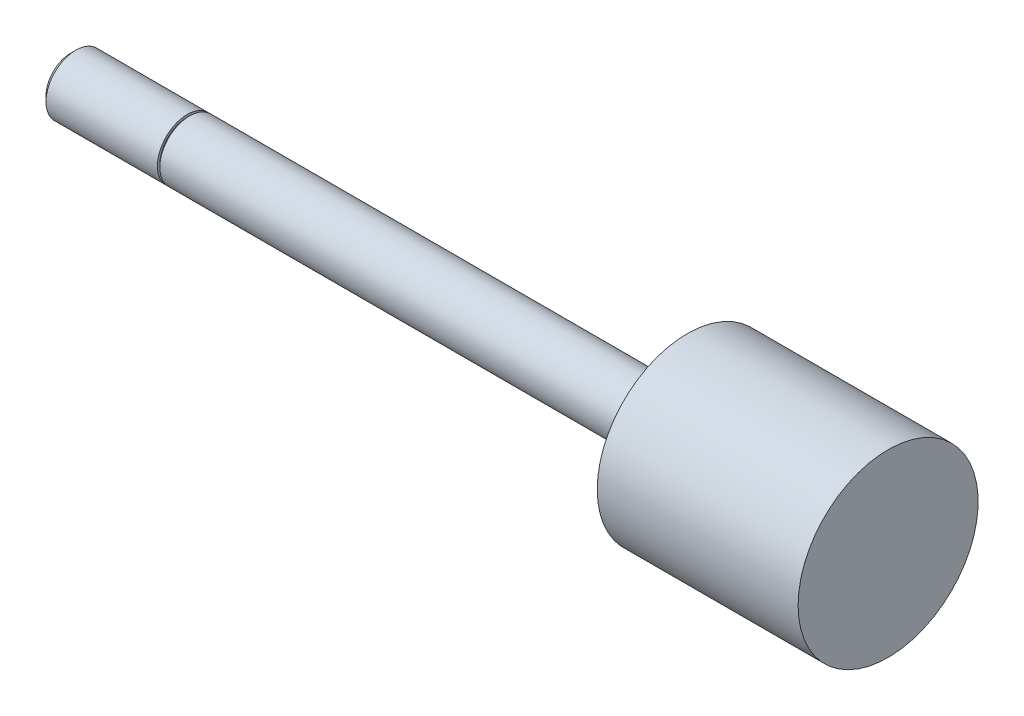
ISO-10303-21;
HEADER;
FILE_DESCRIPTION(('STEP AP214'),'2;1');
FILE_NAME('part.step','',(''),(''),'','','');
FILE_SCHEMA(('AUTOMOTIVE_DESIGN { 1 0 10303 214 1 1 1 1 }'));
ENDSEC;
DATA;
#1=APPLICATION_CONTEXT('core data for automotive mechanical design processes');
#2=APPLICATION_PROTOCOL_DEFINITION('international standard','automotive_design',2000,#1);
#3=PRODUCT_CONTEXT('',#1,'mechanical');
#4=PRODUCT('Part','Part','',(#3));
#5=PRODUCT_RELATED_PRODUCT_CATEGORY('part','',(#4));
#6=PRODUCT_DEFINITION_FORMATION('','',#4);
#7=PRODUCT_DEFINITION_CONTEXT('part definition',#1,'design');
#8=PRODUCT_DEFINITION('design','',#6,#7);
#9=PRODUCT_DEFINITION_SHAPE('','',#8);
#10=(LENGTH_UNIT() NAMED_UNIT(*) SI_UNIT(.MILLI.,.METRE.));
#11=(NAMED_UNIT(*) PLANE_ANGLE_UNIT() SI_UNIT($,.RADIAN.));
#12=(NAMED_UNIT(*) SI_UNIT($,.STERADIAN.) SOLID_ANGLE_UNIT());
#13=UNCERTAINTY_MEASURE_WITH_UNIT(LENGTH_MEASURE(1.E-05),#10,'distance_accuracy_value','');
#14=(GEOMETRIC_REPRESENTATION_CONTEXT(3) GLOBAL_UNCERTAINTY_ASSIGNED_CONTEXT((#13)) GLOBAL_UNIT_ASSIGNED_CONTEXT((#10,
#11,#12)) REPRESENTATION_CONTEXT('',''));
#15=CARTESIAN_POINT('',(0.,0.,0.));
#16=DIRECTION('',(0.,0.,1.));
#17=DIRECTION('',(1.,0.,0.));
#18=AXIS2_PLACEMENT_3D('',#15,#16,#17);
#19=CARTESIAN_POINT('',(74.6506,0.,0.));
#20=DIRECTION('',(-1.,0.,0.));
#21=DIRECTION('',(0.,0.,1.));
#22=AXIS2_PLACEMENT_3D('',#19,#20,#21);
#23=CYLINDRICAL_SURFACE('',#22,3.175);
#24=CARTESIAN_POINT('',(53.1876,0.,0.));
#25=DIRECTION('',(-1.,0.,0.));
#26=DIRECTION('',(0.,0.,1.));
#27=AXIS2_PLACEMENT_3D('',#24,#25,#26);
#28=CIRCLE('',#27,3.175);
#29=CARTESIAN_POINT('',(53.1876,0.,3.175));
#30=VERTEX_POINT('',#29);
#31=EDGE_CURVE('E10',#30,#30,#28,.T.);
#32=ORIENTED_EDGE('',*,*,#31,.T.);
#33=EDGE_LOOP('',(#32));
#34=FACE_BOUND('',#33,.T.);
#35=CARTESIAN_POINT('',(0.,0.,0.));
#36=DIRECTION('',(-1.,0.,0.));
#37=DIRECTION('',(0.,0.,1.));
#38=AXIS2_PLACEMENT_3D('',#35,#36,#37);
#39=CIRCLE('',#38,3.175);
#40=CARTESIAN_POINT('',(0.,0.,3.175));
#41=VERTEX_POINT('',#40);
#42=EDGE_CURVE('E53',#41,#41,#39,.T.);
#43=ORIENTED_EDGE('',*,*,#42,.F.);
#44=EDGE_LOOP('',(#43));
#45=FACE_BOUND('',#44,.T.);
#46=ADVANCED_FACE('F37',(#34,#45),#23,.T.);
#47=CARTESIAN_POINT('',(53.1876,3.175,0.));
#48=DIRECTION('',(1.,0.,0.));
#49=DIRECTION('',(0.,0.,-1.));
#50=AXIS2_PLACEMENT_3D('',#47,#48,#49);
#51=PLANE('',#50);
#52=ORIENTED_EDGE('',*,*,#31,.F.);
#53=EDGE_LOOP('',(#52));
#54=FACE_BOUND('',#53,.T.);
#55=CARTESIAN_POINT('',(53.1876,0.,0.));
#56=DIRECTION('',(-1.,0.,0.));
#57=DIRECTION('',(0.,0.,1.));
#58=AXIS2_PLACEMENT_3D('',#55,#56,#57);
#59=CIRCLE('',#58,9.62025);
#60=CARTESIAN_POINT('',(53.1876,0.,9.62025));
#61=VERTEX_POINT('',#60);
#62=EDGE_CURVE('E45',#61,#61,#59,.T.);
#63=ORIENTED_EDGE('',*,*,#62,.T.);
#64=EDGE_LOOP('',(#63));
#65=FACE_BOUND('',#64,.T.);
#66=ADVANCED_FACE('F87',(#54,#65),#51,.F.);
#67=CARTESIAN_POINT('',(74.6506,0.,0.));
#68=DIRECTION('',(-1.,0.,0.));
#69=DIRECTION('',(0.,0.,1.));
#70=AXIS2_PLACEMENT_3D('',#67,#68,#69);
#71=CYLINDRICAL_SURFACE('',#70,9.62025);
#72=ORIENTED_EDGE('',*,*,#62,.F.);
#73=EDGE_LOOP('',(#72));
#74=FACE_BOUND('',#73,.T.);
#75=CARTESIAN_POINT('',(74.6506,0.,0.));
#76=DIRECTION('',(-1.,0.,0.));
#77=DIRECTION('',(0.,0.,1.));
#78=AXIS2_PLACEMENT_3D('',#75,#76,#77);
#79=CIRCLE('',#78,9.62025);
#80=CARTESIAN_POINT('',(74.6506,0.,9.62025));
#81=VERTEX_POINT('',#80);
#82=EDGE_CURVE('E50',#81,#81,#79,.T.);
#83=ORIENTED_EDGE('',*,*,#82,.T.);
#84=EDGE_LOOP('',(#83));
#85=FACE_BOUND('',#84,.T.);
#86=ADVANCED_FACE('F75',(#74,#85),#71,.T.);
#87=CARTESIAN_POINT('',(74.6506,9.62025,0.));
#88=DIRECTION('',(-1.,0.,0.));
#89=DIRECTION('',(0.,0.,1.));
#90=AXIS2_PLACEMENT_3D('',#87,#88,#89);
#91=PLANE('',#90);
#92=ORIENTED_EDGE('',*,*,#82,.F.);
#93=EDGE_LOOP('',(#92));
#94=FACE_BOUND('',#93,.T.);
#95=ADVANCED_FACE('F77',(#94),#91,.F.);
#96=CARTESIAN_POINT('',(-0.254,3.429,0.));
#97=DIRECTION('',(1.,0.,0.));
#98=DIRECTION('',(0.,0.,-1.));
#99=AXIS2_PLACEMENT_3D('',#96,#97,#98);
#100=PLANE('',#99);
#101=CARTESIAN_POINT('',(-0.254,0.,0.));
#102=DIRECTION('',(-1.,0.,0.));
#103=DIRECTION('',(0.,0.,1.));
#104=AXIS2_PLACEMENT_3D('',#101,#102,#103);
#105=CIRCLE('',#104,2.921);
#106=CARTESIAN_POINT('',(-0.254,0.,2.921));
#107=VERTEX_POINT('',#106);
#108=EDGE_CURVE('E55',#107,#107,#105,.T.);
#109=ORIENTED_EDGE('',*,*,#108,.T.);
#110=EDGE_LOOP('',(#109));
#111=FACE_BOUND('',#110,.T.);
#112=CARTESIAN_POINT('',(-0.254000000000004,0.,0.));
#113=DIRECTION('',(1.,0.,0.));
#114=DIRECTION('',(0.,0.,-1.));
#115=AXIS2_PLACEMENT_3D('',#112,#113,#114);
#116=CIRCLE('',#115,3.175);
#117=CARTESIAN_POINT('',(-0.254000000000004,0.,-3.175));
#118=VERTEX_POINT('',#117);
#119=EDGE_CURVE('E41',#118,#118,#116,.T.);
#120=ORIENTED_EDGE('',*,*,#119,.T.);
#121=EDGE_LOOP('',(#120));
#122=FACE_BOUND('',#121,.T.);
#123=ADVANCED_FACE('F79',(#111,#122),#100,.T.);
#124=CARTESIAN_POINT('',(0.,2.921,0.));
#125=DIRECTION('',(-1.,0.,0.));
#126=DIRECTION('',(0.,0.,1.));
#127=AXIS2_PLACEMENT_3D('',#124,#125,#126);
#128=PLANE('',#127);
#129=CARTESIAN_POINT('',(0.,0.,0.));
#130=DIRECTION('',(-1.,0.,0.));
#131=DIRECTION('',(0.,0.,1.));
#132=AXIS2_PLACEMENT_3D('',#129,#130,#131);
#133=CIRCLE('',#132,2.921);
#134=CARTESIAN_POINT('',(0.,0.,2.921));
#135=VERTEX_POINT('',#134);
#136=EDGE_CURVE('E61',#135,#135,#133,.T.);
#137=ORIENTED_EDGE('',*,*,#136,.F.);
#138=EDGE_LOOP('',(#137));
#139=FACE_BOUND('',#138,.T.);
#140=ORIENTED_EDGE('',*,*,#42,.T.);
#141=EDGE_LOOP('',(#140));
#142=FACE_BOUND('',#141,.T.);
#143=ADVANCED_FACE('F85',(#139,#142),#128,.T.);
#144=CARTESIAN_POINT('',(0.,0.,0.));
#145=DIRECTION('',(-1.,0.,0.));
#146=DIRECTION('',(0.,0.,1.));
#147=AXIS2_PLACEMENT_3D('',#144,#145,#146);
#148=CYLINDRICAL_SURFACE('',#147,2.921);
#149=ORIENTED_EDGE('',*,*,#136,.T.);
#150=EDGE_LOOP('',(#149));
#151=FACE_BOUND('',#150,.T.);
#152=ORIENTED_EDGE('',*,*,#108,.F.);
#153=EDGE_LOOP('',(#152));
#154=FACE_BOUND('',#153,.T.);
#155=ADVANCED_FACE('F114',(#151,#154),#148,.T.);
#156=CARTESIAN_POINT('',(-12.7,0.,0.));
#157=DIRECTION('',(1.,0.,0.));
#158=DIRECTION('',(0.,0.,-1.));
#159=AXIS2_PLACEMENT_3D('',#156,#157,#158);
#160=PLANE('',#159);
#161=CARTESIAN_POINT('',(-12.7,0.,0.));
#162=DIRECTION('',(-1.,0.,0.));
#163=DIRECTION('',(0.,0.,1.));
#164=AXIS2_PLACEMENT_3D('',#161,#162,#163);
#165=CIRCLE('',#164,2.63398);
#166=CARTESIAN_POINT('',(-12.7,0.,2.63398));
#167=VERTEX_POINT('',#166);
#168=EDGE_CURVE('E70',#167,#167,#165,.T.);
#169=ORIENTED_EDGE('',*,*,#168,.T.);
#170=EDGE_LOOP('',(#169));
#171=FACE_BOUND('',#170,.T.);
#172=ADVANCED_FACE('F103',(#171),#160,.F.);
#173=CARTESIAN_POINT('',(-12.15898,0.,0.));
#174=DIRECTION('',(1.,0.,0.));
#175=DIRECTION('',(0.,0.,-1.));
#176=AXIS2_PLACEMENT_3D('',#173,#174,#175);
#177=CONICAL_SURFACE('',#176,3.175,0.785398163397448);
#178=ORIENTED_EDGE('',*,*,#168,.F.);
#179=EDGE_LOOP('',(#178));
#180=FACE_BOUND('',#179,.T.);
#181=CARTESIAN_POINT('',(-12.15898,0.,0.));
#182=DIRECTION('',(-1.,0.,0.));
#183=DIRECTION('',(0.,0.,1.));
#184=AXIS2_PLACEMENT_3D('',#181,#182,#183);
#185=CIRCLE('',#184,3.175);
#186=CARTESIAN_POINT('',(-12.15898,0.,3.175));
#187=VERTEX_POINT('',#186);
#188=EDGE_CURVE('E59',#187,#187,#185,.T.);
#189=ORIENTED_EDGE('',*,*,#188,.T.);
#190=EDGE_LOOP('',(#189));
#191=FACE_BOUND('',#190,.T.);
#192=ADVANCED_FACE('F98',(#180,#191),#177,.T.);
#193=ORIENTED_EDGE('',*,*,#188,.F.);
#194=EDGE_LOOP('',(#193));
#195=FACE_BOUND('',#194,.T.);
#196=ORIENTED_EDGE('',*,*,#119,.F.);
#197=EDGE_LOOP('',(#196));
#198=FACE_BOUND('',#197,.T.);
#199=ADVANCED_FACE('F39',(#195,#198),#23,.T.);
#200=CLOSED_SHELL('',(#46,#66,#86,#95,#123,#143,#155,#172,#192,#199));
#201=MANIFOLD_SOLID_BREP('B2',#200);
#202=ADVANCED_BREP_SHAPE_REPRESENTATION('',(#18,#201),#14);
#203=SHAPE_DEFINITION_REPRESENTATION(#9,#202);
ENDSEC;
END-ISO-10303-21;
